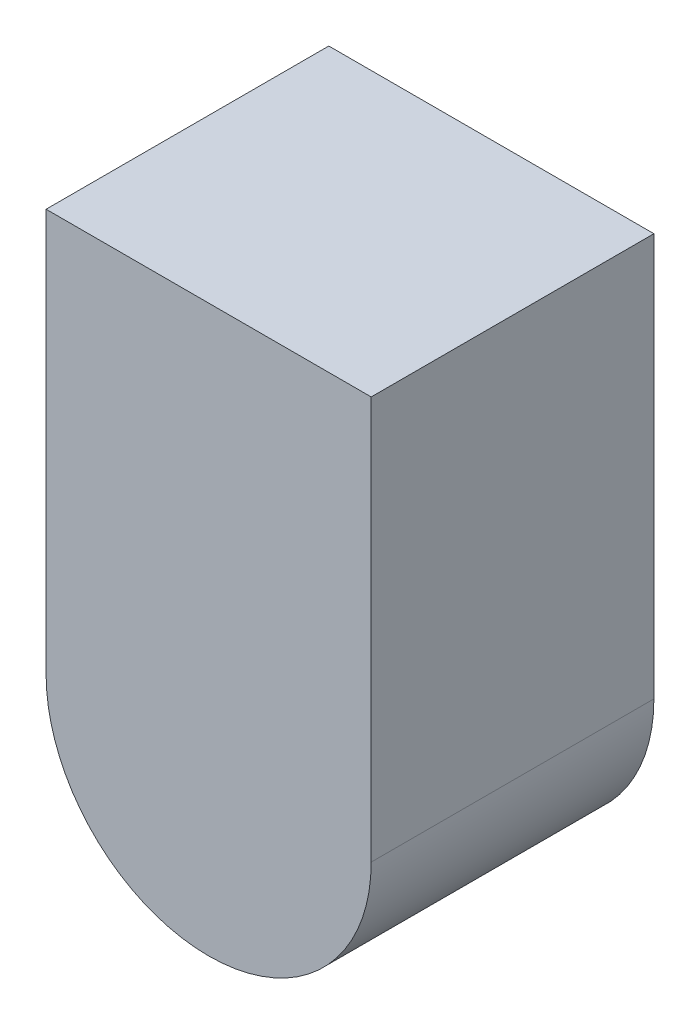
ISO-10303-21;
HEADER;
FILE_DESCRIPTION(('STEP AP214'),'2;1');
FILE_NAME('part.step','',(''),(''),'','','');
FILE_SCHEMA(('AUTOMOTIVE_DESIGN { 1 0 10303 214 1 1 1 1 }'));
ENDSEC;
DATA;
#1=APPLICATION_CONTEXT('core data for automotive mechanical design processes');
#2=APPLICATION_PROTOCOL_DEFINITION('international standard','automotive_design',2000,#1);
#3=PRODUCT_CONTEXT('',#1,'mechanical');
#4=PRODUCT('Part','Part','',(#3));
#5=PRODUCT_RELATED_PRODUCT_CATEGORY('part','',(#4));
#6=PRODUCT_DEFINITION_FORMATION('','',#4);
#7=PRODUCT_DEFINITION_CONTEXT('part definition',#1,'design');
#8=PRODUCT_DEFINITION('design','',#6,#7);
#9=PRODUCT_DEFINITION_SHAPE('','',#8);
#10=(LENGTH_UNIT() NAMED_UNIT(*) SI_UNIT(.MILLI.,.METRE.));
#11=(NAMED_UNIT(*) PLANE_ANGLE_UNIT() SI_UNIT($,.RADIAN.));
#12=(NAMED_UNIT(*) SI_UNIT($,.STERADIAN.) SOLID_ANGLE_UNIT());
#13=UNCERTAINTY_MEASURE_WITH_UNIT(LENGTH_MEASURE(1.E-05),#10,'distance_accuracy_value','');
#14=(GEOMETRIC_REPRESENTATION_CONTEXT(3) GLOBAL_UNCERTAINTY_ASSIGNED_CONTEXT((#13)) GLOBAL_UNIT_ASSIGNED_CONTEXT((#10,
#11,#12)) REPRESENTATION_CONTEXT('',''));
#15=CARTESIAN_POINT('',(0.,0.,0.));
#16=DIRECTION('',(0.,0.,1.));
#17=DIRECTION('',(1.,0.,0.));
#18=AXIS2_PLACEMENT_3D('',#15,#16,#17);
#19=CARTESIAN_POINT('',(-2.25,2.8335240809167,0.2));
#20=DIRECTION('',(0.,0.,1.));
#21=DIRECTION('',(1.,0.,0.));
#22=AXIS2_PLACEMENT_3D('',#19,#20,#21);
#23=PLANE('',#22);
#24=DIRECTION('',(0.,1.,0.));
#25=VECTOR('',#24,1.);
#26=CARTESIAN_POINT('',(-2.135,2.715,0.2));
#27=LINE('',#26,#25);
#28=CARTESIAN_POINT('',(-2.135,2.715,0.2));
#29=VERTEX_POINT('',#28);
#30=CARTESIAN_POINT('',(-2.135,3.,0.2));
#31=VERTEX_POINT('',#30);
#32=EDGE_CURVE('E11',#29,#31,#27,.T.);
#33=ORIENTED_EDGE('',*,*,#32,.T.);
#34=DIRECTION('',(-1.,0.,0.));
#35=VECTOR('',#34,1.);
#36=CARTESIAN_POINT('',(0.375,3.,0.2));
#37=LINE('',#36,#35);
#38=CARTESIAN_POINT('',(-2.365,3.,0.2));
#39=VERTEX_POINT('',#38);
#40=EDGE_CURVE('E24',#31,#39,#37,.T.);
#41=ORIENTED_EDGE('',*,*,#40,.T.);
#42=DIRECTION('',(0.,-1.,0.));
#43=VECTOR('',#42,1.);
#44=CARTESIAN_POINT('',(-2.365,3.,0.2));
#45=LINE('',#44,#43);
#46=CARTESIAN_POINT('',(-2.365,2.715,0.2));
#47=VERTEX_POINT('',#46);
#48=EDGE_CURVE('E88',#39,#47,#45,.T.);
#49=ORIENTED_EDGE('',*,*,#48,.T.);
#50=CARTESIAN_POINT('',(-2.25,2.715,0.2));
#51=DIRECTION('',(0.,0.,1.));
#52=DIRECTION('',(-1.,0.,0.));
#53=AXIS2_PLACEMENT_3D('',#50,#51,#52);
#54=CIRCLE('',#53,0.115);
#55=EDGE_CURVE('E70',#47,#29,#54,.T.);
#56=ORIENTED_EDGE('',*,*,#55,.T.);
#57=EDGE_LOOP('',(#33,#41,#49,#56));
#58=FACE_BOUND('',#57,.T.);
#59=ADVANCED_FACE('F17',(#58),#23,.T.);
#60=CARTESIAN_POINT('',(3.,3.,0.));
#61=DIRECTION('',(0.,1.,0.));
#62=DIRECTION('',(-1.,0.,0.));
#63=AXIS2_PLACEMENT_3D('',#60,#61,#62);
#64=PLANE('',#63);
#65=DIRECTION('',(0.,0.,-1.));
#66=VECTOR('',#65,1.);
#67=CARTESIAN_POINT('',(-2.365,3.,0.));
#68=LINE('',#67,#66);
#69=CARTESIAN_POINT('',(-2.365,3.,0.));
#70=VERTEX_POINT('',#69);
#71=EDGE_CURVE('E76',#39,#70,#68,.T.);
#72=ORIENTED_EDGE('',*,*,#71,.F.);
#73=ORIENTED_EDGE('',*,*,#40,.F.);
#74=DIRECTION('',(0.,0.,1.));
#75=VECTOR('',#74,1.);
#76=CARTESIAN_POINT('',(-2.135,3.,0.));
#77=LINE('',#76,#75);
#78=CARTESIAN_POINT('',(-2.135,3.,0.));
#79=VERTEX_POINT('',#78);
#80=EDGE_CURVE('E84',#79,#31,#77,.T.);
#81=ORIENTED_EDGE('',*,*,#80,.F.);
#82=DIRECTION('',(-1.,0.,0.));
#83=VECTOR('',#82,1.);
#84=CARTESIAN_POINT('',(-2.135,3.,0.));
#85=LINE('',#84,#83);
#86=EDGE_CURVE('E82',#79,#70,#85,.T.);
#87=ORIENTED_EDGE('',*,*,#86,.T.);
#88=EDGE_LOOP('',(#72,#73,#81,#87));
#89=FACE_BOUND('',#88,.T.);
#90=ADVANCED_FACE('F90',(#89),#64,.T.);
#91=CARTESIAN_POINT('',(-2.135,2.715,0.));
#92=DIRECTION('',(1.,0.,0.));
#93=DIRECTION('',(0.,1.,0.));
#94=AXIS2_PLACEMENT_3D('',#91,#92,#93);
#95=PLANE('',#94);
#96=DIRECTION('',(0.,1.,0.));
#97=VECTOR('',#96,1.);
#98=CARTESIAN_POINT('',(-2.135,2.715,0.));
#99=LINE('',#98,#97);
#100=CARTESIAN_POINT('',(-2.135,2.715,0.));
#101=VERTEX_POINT('',#100);
#102=EDGE_CURVE('E61',#101,#79,#99,.T.);
#103=ORIENTED_EDGE('',*,*,#102,.T.);
#104=ORIENTED_EDGE('',*,*,#80,.T.);
#105=ORIENTED_EDGE('',*,*,#32,.F.);
#106=DIRECTION('',(0.,0.,1.));
#107=VECTOR('',#106,1.);
#108=CARTESIAN_POINT('',(-2.135,2.715,0.));
#109=LINE('',#108,#107);
#110=EDGE_CURVE('E64',#101,#29,#109,.T.);
#111=ORIENTED_EDGE('',*,*,#110,.F.);
#112=EDGE_LOOP('',(#103,#104,#105,#111));
#113=FACE_BOUND('',#112,.T.);
#114=ADVANCED_FACE('F91',(#113),#95,.T.);
#115=CARTESIAN_POINT('',(-2.25,2.715,0.));
#116=DIRECTION('',(0.,0.,1.));
#117=DIRECTION('',(-1.,0.,0.));
#118=AXIS2_PLACEMENT_3D('',#115,#116,#117);
#119=CYLINDRICAL_SURFACE('',#118,0.115);
#120=CARTESIAN_POINT('',(-2.25,2.715,0.));
#121=DIRECTION('',(0.,0.,1.));
#122=DIRECTION('',(-1.,0.,0.));
#123=AXIS2_PLACEMENT_3D('',#120,#121,#122);
#124=CIRCLE('',#123,0.115);
#125=CARTESIAN_POINT('',(-2.365,2.715,0.));
#126=VERTEX_POINT('',#125);
#127=EDGE_CURVE('E54',#126,#101,#124,.T.);
#128=ORIENTED_EDGE('',*,*,#127,.T.);
#129=ORIENTED_EDGE('',*,*,#110,.T.);
#130=ORIENTED_EDGE('',*,*,#55,.F.);
#131=DIRECTION('',(0.,0.,1.));
#132=VECTOR('',#131,1.);
#133=CARTESIAN_POINT('',(-2.365,2.715,0.));
#134=LINE('',#133,#132);
#135=EDGE_CURVE('E65',#126,#47,#134,.T.);
#136=ORIENTED_EDGE('',*,*,#135,.F.);
#137=EDGE_LOOP('',(#128,#129,#130,#136));
#138=FACE_BOUND('',#137,.T.);
#139=ADVANCED_FACE('F69',(#138),#119,.T.);
#140=CARTESIAN_POINT('',(-2.365,3.,0.));
#141=DIRECTION('',(-1.,0.,0.));
#142=DIRECTION('',(0.,-1.,0.));
#143=AXIS2_PLACEMENT_3D('',#140,#141,#142);
#144=PLANE('',#143);
#145=DIRECTION('',(0.,-1.,0.));
#146=VECTOR('',#145,1.);
#147=CARTESIAN_POINT('',(-2.365,3.,0.));
#148=LINE('',#147,#146);
#149=EDGE_CURVE('E59',#70,#126,#148,.T.);
#150=ORIENTED_EDGE('',*,*,#149,.T.);
#151=ORIENTED_EDGE('',*,*,#135,.T.);
#152=ORIENTED_EDGE('',*,*,#48,.F.);
#153=ORIENTED_EDGE('',*,*,#71,.T.);
#154=EDGE_LOOP('',(#150,#151,#152,#153));
#155=FACE_BOUND('',#154,.T.);
#156=ADVANCED_FACE('F74',(#155),#144,.T.);
#157=CARTESIAN_POINT('',(-2.25,2.8335265642716,0.));
#158=DIRECTION('',(0.,0.,1.));
#159=DIRECTION('',(0.,-1.,0.));
#160=AXIS2_PLACEMENT_3D('',#157,#158,#159);
#161=PLANE('',#160);
#162=ORIENTED_EDGE('',*,*,#86,.F.);
#163=ORIENTED_EDGE('',*,*,#102,.F.);
#164=ORIENTED_EDGE('',*,*,#127,.F.);
#165=ORIENTED_EDGE('',*,*,#149,.F.);
#166=EDGE_LOOP('',(#162,#163,#164,#165));
#167=FACE_BOUND('',#166,.T.);
#168=ADVANCED_FACE('F57',(#167),#161,.F.);
#169=CLOSED_SHELL('',(#59,#90,#114,#139,#156,#168));
#170=MANIFOLD_SOLID_BREP('B1',#169);
#171=ADVANCED_BREP_SHAPE_REPRESENTATION('',(#18,#170),#14);
#172=SHAPE_DEFINITION_REPRESENTATION(#9,#171);
ENDSEC;
END-ISO-10303-21;
